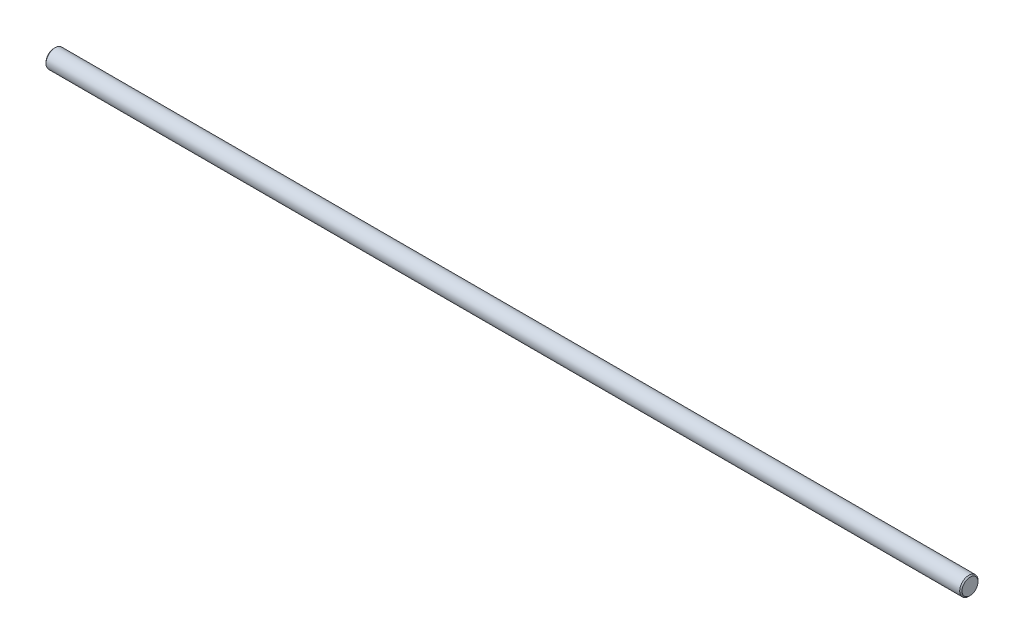
ISO-10303-21;
HEADER;
FILE_DESCRIPTION(('STEP AP214'),'2;1');
FILE_NAME('part.step','',(''),(''),'','','');
FILE_SCHEMA(('AUTOMOTIVE_DESIGN { 1 0 10303 214 1 1 1 1 }'));
ENDSEC;
DATA;
#1=APPLICATION_CONTEXT('core data for automotive mechanical design processes');
#2=APPLICATION_PROTOCOL_DEFINITION('international standard','automotive_design',2000,#1);
#3=PRODUCT_CONTEXT('',#1,'mechanical');
#4=PRODUCT('Part','Part','',(#3));
#5=PRODUCT_RELATED_PRODUCT_CATEGORY('part','',(#4));
#6=PRODUCT_DEFINITION_FORMATION('','',#4);
#7=PRODUCT_DEFINITION_CONTEXT('part definition',#1,'design');
#8=PRODUCT_DEFINITION('design','',#6,#7);
#9=PRODUCT_DEFINITION_SHAPE('','',#8);
#10=(LENGTH_UNIT() NAMED_UNIT(*) SI_UNIT(.MILLI.,.METRE.));
#11=(NAMED_UNIT(*) PLANE_ANGLE_UNIT() SI_UNIT($,.RADIAN.));
#12=(NAMED_UNIT(*) SI_UNIT($,.STERADIAN.) SOLID_ANGLE_UNIT());
#13=UNCERTAINTY_MEASURE_WITH_UNIT(LENGTH_MEASURE(1.E-05),#10,'distance_accuracy_value','');
#14=(GEOMETRIC_REPRESENTATION_CONTEXT(3) GLOBAL_UNCERTAINTY_ASSIGNED_CONTEXT((#13)) GLOBAL_UNIT_ASSIGNED_CONTEXT((#10,
#11,#12)) REPRESENTATION_CONTEXT('',''));
#15=CARTESIAN_POINT('',(0.,0.,0.));
#16=DIRECTION('',(0.,0.,1.));
#17=DIRECTION('',(1.,0.,0.));
#18=AXIS2_PLACEMENT_3D('',#15,#16,#17);
#19=CARTESIAN_POINT('',(0.,0.,0.));
#20=DIRECTION('',(1.,0.,0.));
#21=DIRECTION('',(0.,0.,-1.));
#22=AXIS2_PLACEMENT_3D('',#19,#20,#21);
#23=PLANE('',#22);
#24=CARTESIAN_POINT('',(0.,0.,0.));
#25=DIRECTION('',(-1.,0.,0.));
#26=DIRECTION('',(0.,0.,1.));
#27=AXIS2_PLACEMENT_3D('',#24,#25,#26);
#28=CIRCLE('',#27,3.5);
#29=CARTESIAN_POINT('',(0.,0.,3.5));
#30=VERTEX_POINT('',#29);
#31=EDGE_CURVE('E10',#30,#30,#28,.T.);
#32=ORIENTED_EDGE('',*,*,#31,.T.);
#33=EDGE_LOOP('',(#32));
#34=FACE_BOUND('',#33,.T.);
#35=ADVANCED_FACE('F30',(#34),#23,.F.);
#36=CARTESIAN_POINT('',(0.5,0.,0.));
#37=DIRECTION('',(1.,0.,0.));
#38=DIRECTION('',(0.,0.,-1.));
#39=AXIS2_PLACEMENT_3D('',#36,#37,#38);
#40=CONICAL_SURFACE('',#39,4.,0.785398163397448);
#41=ORIENTED_EDGE('',*,*,#31,.F.);
#42=EDGE_LOOP('',(#41));
#43=FACE_BOUND('',#42,.T.);
#44=CARTESIAN_POINT('',(0.5,0.,0.));
#45=DIRECTION('',(-1.,0.,0.));
#46=DIRECTION('',(0.,0.,1.));
#47=AXIS2_PLACEMENT_3D('',#44,#45,#46);
#48=CIRCLE('',#47,4.);
#49=CARTESIAN_POINT('',(0.5,0.,4.));
#50=VERTEX_POINT('',#49);
#51=EDGE_CURVE('E36',#50,#50,#48,.T.);
#52=ORIENTED_EDGE('',*,*,#51,.T.);
#53=EDGE_LOOP('',(#52));
#54=FACE_BOUND('',#53,.T.);
#55=ADVANCED_FACE('F62',(#43,#54),#40,.T.);
#56=CARTESIAN_POINT('',(400.,0.,0.));
#57=DIRECTION('',(-1.,0.,0.));
#58=DIRECTION('',(0.,0.,1.));
#59=AXIS2_PLACEMENT_3D('',#56,#57,#58);
#60=CYLINDRICAL_SURFACE('',#59,4.);
#61=ORIENTED_EDGE('',*,*,#51,.F.);
#62=EDGE_LOOP('',(#61));
#63=FACE_BOUND('',#62,.T.);
#64=CARTESIAN_POINT('',(399.5,0.,0.));
#65=DIRECTION('',(-1.,0.,0.));
#66=DIRECTION('',(0.,0.,1.));
#67=AXIS2_PLACEMENT_3D('',#64,#65,#66);
#68=CIRCLE('',#67,4.);
#69=CARTESIAN_POINT('',(399.5,0.,4.));
#70=VERTEX_POINT('',#69);
#71=EDGE_CURVE('E40',#70,#70,#68,.T.);
#72=ORIENTED_EDGE('',*,*,#71,.T.);
#73=EDGE_LOOP('',(#72));
#74=FACE_BOUND('',#73,.T.);
#75=ADVANCED_FACE('F58',(#63,#74),#60,.T.);
#76=CARTESIAN_POINT('',(400.,0.,0.));
#77=DIRECTION('',(-1.,0.,0.));
#78=DIRECTION('',(0.,0.,1.));
#79=AXIS2_PLACEMENT_3D('',#76,#77,#78);
#80=CONICAL_SURFACE('',#79,3.5,0.785398163397448);
#81=ORIENTED_EDGE('',*,*,#71,.F.);
#82=EDGE_LOOP('',(#81));
#83=FACE_BOUND('',#82,.T.);
#84=CARTESIAN_POINT('',(400.,0.,0.));
#85=DIRECTION('',(-1.,0.,0.));
#86=DIRECTION('',(0.,0.,1.));
#87=AXIS2_PLACEMENT_3D('',#84,#85,#86);
#88=CIRCLE('',#87,3.5);
#89=CARTESIAN_POINT('',(400.,0.,3.5));
#90=VERTEX_POINT('',#89);
#91=EDGE_CURVE('E44',#90,#90,#88,.T.);
#92=ORIENTED_EDGE('',*,*,#91,.T.);
#93=EDGE_LOOP('',(#92));
#94=FACE_BOUND('',#93,.T.);
#95=ADVANCED_FACE('F50',(#83,#94),#80,.T.);
#96=CARTESIAN_POINT('',(400.,3.5,0.));
#97=DIRECTION('',(-1.,0.,0.));
#98=DIRECTION('',(0.,0.,1.));
#99=AXIS2_PLACEMENT_3D('',#96,#97,#98);
#100=PLANE('',#99);
#101=ORIENTED_EDGE('',*,*,#91,.F.);
#102=EDGE_LOOP('',(#101));
#103=FACE_BOUND('',#102,.T.);
#104=ADVANCED_FACE('F52',(#103),#100,.F.);
#105=CLOSED_SHELL('',(#35,#55,#75,#95,#104));
#106=MANIFOLD_SOLID_BREP('B2',#105);
#107=ADVANCED_BREP_SHAPE_REPRESENTATION('',(#18,#106),#14);
#108=SHAPE_DEFINITION_REPRESENTATION(#9,#107);
ENDSEC;
END-ISO-10303-21;
